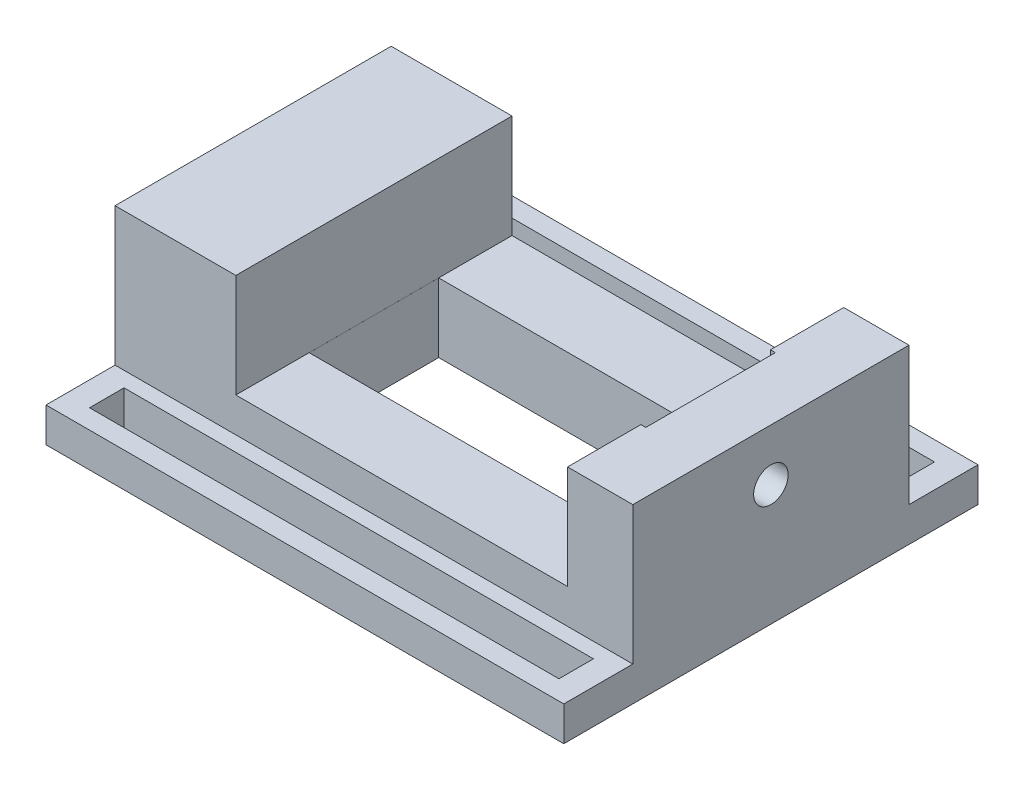
ISO-10303-21;
HEADER;
FILE_DESCRIPTION(('STEP AP214'),'2;1');
FILE_NAME('part.step','',(''),(''),'','','');
FILE_SCHEMA(('AUTOMOTIVE_DESIGN { 1 0 10303 214 1 1 1 1 }'));
ENDSEC;
DATA;
#1=APPLICATION_CONTEXT('core data for automotive mechanical design processes');
#2=APPLICATION_PROTOCOL_DEFINITION('international standard','automotive_design',2000,#1);
#3=PRODUCT_CONTEXT('',#1,'mechanical');
#4=PRODUCT('Part','Part','',(#3));
#5=PRODUCT_RELATED_PRODUCT_CATEGORY('part','',(#4));
#6=PRODUCT_DEFINITION_FORMATION('','',#4);
#7=PRODUCT_DEFINITION_CONTEXT('part definition',#1,'design');
#8=PRODUCT_DEFINITION('design','',#6,#7);
#9=PRODUCT_DEFINITION_SHAPE('','',#8);
#10=(LENGTH_UNIT() NAMED_UNIT(*) SI_UNIT(.MILLI.,.METRE.));
#11=(NAMED_UNIT(*) PLANE_ANGLE_UNIT() SI_UNIT($,.RADIAN.));
#12=(NAMED_UNIT(*) SI_UNIT($,.STERADIAN.) SOLID_ANGLE_UNIT());
#13=UNCERTAINTY_MEASURE_WITH_UNIT(LENGTH_MEASURE(1.E-05),#10,'distance_accuracy_value','');
#14=(GEOMETRIC_REPRESENTATION_CONTEXT(3) GLOBAL_UNCERTAINTY_ASSIGNED_CONTEXT((#13)) GLOBAL_UNIT_ASSIGNED_CONTEXT((#10,
#11,#12)) REPRESENTATION_CONTEXT('',''));
#15=CARTESIAN_POINT('',(0.,0.,0.));
#16=DIRECTION('',(0.,0.,1.));
#17=DIRECTION('',(1.,0.,0.));
#18=AXIS2_PLACEMENT_3D('',#15,#16,#17);
#19=CARTESIAN_POINT('',(56.092988376453,40.,-60.));
#20=DIRECTION('',(1.,0.,0.));
#21=DIRECTION('',(0.,1.,0.));
#22=AXIS2_PLACEMENT_3D('',#19,#20,#21);
#23=PLANE('',#22);
#24=DIRECTION('',(0.,0.,1.));
#25=VECTOR('',#24,1.);
#26=CARTESIAN_POINT('',(56.092988376453,10.,-60.));
#27=LINE('',#26,#25);
#28=CARTESIAN_POINT('',(56.092988376453,10.,-40.));
#29=VERTEX_POINT('',#28);
#30=CARTESIAN_POINT('',(56.092988376453,10.,-18.7674200357719));
#31=VERTEX_POINT('',#30);
#32=EDGE_CURVE('E282',#29,#31,#27,.T.);
#33=ORIENTED_EDGE('',*,*,#32,.T.);
#34=DIRECTION('',(0.,1.,0.));
#35=VECTOR('',#34,1.);
#36=CARTESIAN_POINT('',(56.092988376453,40.,-18.7674200357719));
#37=LINE('',#36,#35);
#38=CARTESIAN_POINT('',(56.092988376453,40.,-18.7674200357719));
#39=VERTEX_POINT('',#38);
#40=EDGE_CURVE('E49',#31,#39,#37,.T.);
#41=ORIENTED_EDGE('',*,*,#40,.T.);
#42=DIRECTION('',(0.,0.,-1.));
#43=VECTOR('',#42,1.);
#44=CARTESIAN_POINT('',(56.092988376453,40.,0.));
#45=LINE('',#44,#43);
#46=CARTESIAN_POINT('',(56.092988376453,40.,-40.));
#47=VERTEX_POINT('',#46);
#48=EDGE_CURVE('E473',#39,#47,#45,.T.);
#49=ORIENTED_EDGE('',*,*,#48,.T.);
#50=DIRECTION('',(0.,1.,0.));
#51=VECTOR('',#50,1.);
#52=CARTESIAN_POINT('',(56.092988376453,40.,-40.));
#53=LINE('',#52,#51);
#54=EDGE_CURVE('E286',#29,#47,#53,.T.);
#55=ORIENTED_EDGE('',*,*,#54,.F.);
#56=EDGE_LOOP('',(#33,#41,#49,#55));
#57=FACE_BOUND('',#56,.T.);
#58=ADVANCED_FACE('F39',(#57),#23,.F.);
#59=CARTESIAN_POINT('',(0.,40.,0.));
#60=DIRECTION('',(0.,1.,0.));
#61=DIRECTION('',(0.,0.,1.));
#62=AXIS2_PLACEMENT_3D('',#59,#60,#61);
#63=PLANE('',#62);
#64=DIRECTION('',(0.,0.,1.));
#65=VECTOR('',#64,1.);
#66=CARTESIAN_POINT('',(-40.,40.,0.));
#67=LINE('',#66,#65);
#68=CARTESIAN_POINT('',(-40.,40.,-40.));
#69=VERTEX_POINT('',#68);
#70=CARTESIAN_POINT('',(-40.,40.,40.));
#71=VERTEX_POINT('',#70);
#72=EDGE_CURVE('E477',#69,#71,#67,.T.);
#73=ORIENTED_EDGE('',*,*,#72,.F.);
#74=DIRECTION('',(-1.,0.,0.));
#75=VECTOR('',#74,1.);
#76=CARTESIAN_POINT('',(-75.,40.,-40.));
#77=LINE('',#76,#75);
#78=CARTESIAN_POINT('',(-75.,40.,-40.));
#79=VERTEX_POINT('',#78);
#80=EDGE_CURVE('E437',#69,#79,#77,.T.);
#81=ORIENTED_EDGE('',*,*,#80,.T.);
#82=DIRECTION('',(0.,0.,1.));
#83=VECTOR('',#82,1.);
#84=CARTESIAN_POINT('',(-75.,40.,-40.));
#85=LINE('',#84,#83);
#86=CARTESIAN_POINT('',(-75.,40.,40.));
#87=VERTEX_POINT('',#86);
#88=EDGE_CURVE('E443',#79,#87,#85,.T.);
#89=ORIENTED_EDGE('',*,*,#88,.T.);
#90=DIRECTION('',(1.,0.,0.));
#91=VECTOR('',#90,1.);
#92=CARTESIAN_POINT('',(-75.,40.,40.));
#93=LINE('',#92,#91);
#94=EDGE_CURVE('E447',#87,#71,#93,.T.);
#95=ORIENTED_EDGE('',*,*,#94,.T.);
#96=EDGE_LOOP('',(#73,#81,#89,#95));
#97=FACE_BOUND('',#96,.T.);
#98=ADVANCED_FACE('F563',(#97),#63,.T.);
#99=CARTESIAN_POINT('',(75.,40.,-40.));
#100=DIRECTION('',(-1.,0.,0.));
#101=DIRECTION('',(0.,0.,1.));
#102=AXIS2_PLACEMENT_3D('',#99,#100,#101);
#103=PLANE('',#102);
#104=CARTESIAN_POINT('',(75.,25.,0.));
#105=DIRECTION('',(1.,0.,0.));
#106=DIRECTION('',(0.,0.,-1.));
#107=AXIS2_PLACEMENT_3D('',#104,#105,#106);
#108=CIRCLE('',#107,5.);
#109=CARTESIAN_POINT('',(75.,25.,-4.99999999999999));
#110=VERTEX_POINT('',#109);
#111=EDGE_CURVE('E244',#110,#110,#108,.T.);
#112=ORIENTED_EDGE('',*,*,#111,.F.);
#113=EDGE_LOOP('',(#112));
#114=FACE_BOUND('',#113,.T.);
#115=DIRECTION('',(0.,-1.,0.));
#116=VECTOR('',#115,1.);
#117=CARTESIAN_POINT('',(75.,40.,40.));
#118=LINE('',#117,#116);
#119=CARTESIAN_POINT('',(75.,40.,40.));
#120=VERTEX_POINT('',#119);
#121=CARTESIAN_POINT('',(75.,0.,40.));
#122=VERTEX_POINT('',#121);
#123=EDGE_CURVE('E451',#120,#122,#118,.T.);
#124=ORIENTED_EDGE('',*,*,#123,.T.);
#125=DIRECTION('',(0.,0.,1.));
#126=VECTOR('',#125,1.);
#127=CARTESIAN_POINT('',(75.,0.,-60.));
#128=LINE('',#127,#126);
#129=CARTESIAN_POINT('',(75.,0.,60.));
#130=VERTEX_POINT('',#129);
#131=EDGE_CURVE('E410',#122,#130,#128,.T.);
#132=ORIENTED_EDGE('',*,*,#131,.T.);
#133=DIRECTION('',(0.,1.,0.));
#134=VECTOR('',#133,1.);
#135=CARTESIAN_POINT('',(75.,-10.,60.));
#136=LINE('',#135,#134);
#137=CARTESIAN_POINT('',(75.,-10.,60.));
#138=VERTEX_POINT('',#137);
#139=EDGE_CURVE('E420',#138,#130,#136,.T.);
#140=ORIENTED_EDGE('',*,*,#139,.F.);
#141=DIRECTION('',(0.,0.,1.));
#142=VECTOR('',#141,1.);
#143=CARTESIAN_POINT('',(75.,-10.,-60.));
#144=LINE('',#143,#142);
#145=CARTESIAN_POINT('',(75.,-10.,-60.));
#146=VERTEX_POINT('',#145);
#147=EDGE_CURVE('E396',#146,#138,#144,.T.);
#148=ORIENTED_EDGE('',*,*,#147,.F.);
#149=DIRECTION('',(0.,1.,0.));
#150=VECTOR('',#149,1.);
#151=CARTESIAN_POINT('',(75.,-10.,-60.));
#152=LINE('',#151,#150);
#153=CARTESIAN_POINT('',(75.,0.,-60.));
#154=VERTEX_POINT('',#153);
#155=EDGE_CURVE('E424',#146,#154,#152,.T.);
#156=ORIENTED_EDGE('',*,*,#155,.T.);
#157=CARTESIAN_POINT('',(75.,0.,-40.));
#158=VERTEX_POINT('',#157);
#159=EDGE_CURVE('E411',#154,#158,#128,.T.);
#160=ORIENTED_EDGE('',*,*,#159,.T.);
#161=DIRECTION('',(0.,-1.,0.));
#162=VECTOR('',#161,1.);
#163=CARTESIAN_POINT('',(75.,40.,-40.));
#164=LINE('',#163,#162);
#165=CARTESIAN_POINT('',(75.,40.,-40.));
#166=VERTEX_POINT('',#165);
#167=EDGE_CURVE('E469',#166,#158,#164,.T.);
#168=ORIENTED_EDGE('',*,*,#167,.F.);
#169=DIRECTION('',(0.,0.,-1.));
#170=VECTOR('',#169,1.);
#171=CARTESIAN_POINT('',(75.,40.,-40.));
#172=LINE('',#171,#170);
#173=EDGE_CURVE('E433',#120,#166,#172,.T.);
#174=ORIENTED_EDGE('',*,*,#173,.F.);
#175=EDGE_LOOP('',(#124,#132,#140,#148,#156,#160,#168,#174));
#176=FACE_BOUND('',#175,.T.);
#177=ADVANCED_FACE('F41',(#114,#176),#103,.F.);
#178=CARTESIAN_POINT('',(-75.,40.,-40.));
#179=DIRECTION('',(0.,0.,1.));
#180=DIRECTION('',(1.,0.,0.));
#181=AXIS2_PLACEMENT_3D('',#178,#179,#180);
#182=PLANE('',#181);
#183=ORIENTED_EDGE('',*,*,#80,.F.);
#184=DIRECTION('',(0.,-1.,0.));
#185=VECTOR('',#184,1.);
#186=CARTESIAN_POINT('',(-40.,40.,-40.));
#187=LINE('',#186,#185);
#188=CARTESIAN_POINT('',(-40.,10.,-40.));
#189=VERTEX_POINT('',#188);
#190=EDGE_CURVE('E293',#69,#189,#187,.T.);
#191=ORIENTED_EDGE('',*,*,#190,.T.);
#192=DIRECTION('',(1.,0.,0.));
#193=VECTOR('',#192,1.);
#194=CARTESIAN_POINT('',(-75.,10.,-40.));
#195=LINE('',#194,#193);
#196=EDGE_CURVE('E297',#189,#29,#195,.T.);
#197=ORIENTED_EDGE('',*,*,#196,.T.);
#198=ORIENTED_EDGE('',*,*,#54,.T.);
#199=EDGE_CURVE('E439',#166,#47,#77,.T.);
#200=ORIENTED_EDGE('',*,*,#199,.F.);
#201=ORIENTED_EDGE('',*,*,#167,.T.);
#202=DIRECTION('',(-1.,0.,0.));
#203=VECTOR('',#202,1.);
#204=CARTESIAN_POINT('',(-75.,0.,-40.));
#205=LINE('',#204,#203);
#206=CARTESIAN_POINT('',(-75.,0.,-40.));
#207=VERTEX_POINT('',#206);
#208=EDGE_CURVE('E432',#158,#207,#205,.T.);
#209=ORIENTED_EDGE('',*,*,#208,.T.);
#210=DIRECTION('',(0.,-1.,0.));
#211=VECTOR('',#210,1.);
#212=CARTESIAN_POINT('',(-75.,40.,-40.));
#213=LINE('',#212,#211);
#214=EDGE_CURVE('E465',#79,#207,#213,.T.);
#215=ORIENTED_EDGE('',*,*,#214,.F.);
#216=EDGE_LOOP('',(#183,#191,#197,#198,#200,#201,#209,#215));
#217=FACE_BOUND('',#216,.T.);
#218=ADVANCED_FACE('F512',(#217),#182,.F.);
#219=CARTESIAN_POINT('',(-75.,40.,-40.));
#220=DIRECTION('',(1.,0.,0.));
#221=DIRECTION('',(0.,0.,-1.));
#222=AXIS2_PLACEMENT_3D('',#219,#220,#221);
#223=PLANE('',#222);
#224=ORIENTED_EDGE('',*,*,#214,.T.);
#225=DIRECTION('',(0.,0.,-1.));
#226=VECTOR('',#225,1.);
#227=CARTESIAN_POINT('',(-75.,0.,-60.));
#228=LINE('',#227,#226);
#229=CARTESIAN_POINT('',(-75.,0.,-60.));
#230=VERTEX_POINT('',#229);
#231=EDGE_CURVE('E387',#207,#230,#228,.T.);
#232=ORIENTED_EDGE('',*,*,#231,.T.);
#233=DIRECTION('',(0.,1.,0.));
#234=VECTOR('',#233,1.);
#235=CARTESIAN_POINT('',(-75.,-10.,-60.));
#236=LINE('',#235,#234);
#237=CARTESIAN_POINT('',(-75.,-10.,-60.));
#238=VERTEX_POINT('',#237);
#239=EDGE_CURVE('E428',#238,#230,#236,.T.);
#240=ORIENTED_EDGE('',*,*,#239,.F.);
#241=DIRECTION('',(0.,0.,-1.));
#242=VECTOR('',#241,1.);
#243=CARTESIAN_POINT('',(-75.,-10.,-60.));
#244=LINE('',#243,#242);
#245=CARTESIAN_POINT('',(-75.,-10.,60.));
#246=VERTEX_POINT('',#245);
#247=EDGE_CURVE('E388',#246,#238,#244,.T.);
#248=ORIENTED_EDGE('',*,*,#247,.F.);
#249=DIRECTION('',(0.,1.,0.));
#250=VECTOR('',#249,1.);
#251=CARTESIAN_POINT('',(-75.,-10.,60.));
#252=LINE('',#251,#250);
#253=CARTESIAN_POINT('',(-75.,0.,60.));
#254=VERTEX_POINT('',#253);
#255=EDGE_CURVE('E402',#246,#254,#252,.T.);
#256=ORIENTED_EDGE('',*,*,#255,.T.);
#257=CARTESIAN_POINT('',(-75.,0.,40.));
#258=VERTEX_POINT('',#257);
#259=EDGE_CURVE('E403',#254,#258,#228,.T.);
#260=ORIENTED_EDGE('',*,*,#259,.T.);
#261=DIRECTION('',(0.,-1.,0.));
#262=VECTOR('',#261,1.);
#263=CARTESIAN_POINT('',(-75.,40.,40.));
#264=LINE('',#263,#262);
#265=EDGE_CURVE('E461',#87,#258,#264,.T.);
#266=ORIENTED_EDGE('',*,*,#265,.F.);
#267=ORIENTED_EDGE('',*,*,#88,.F.);
#268=EDGE_LOOP('',(#224,#232,#240,#248,#256,#260,#266,#267));
#269=FACE_BOUND('',#268,.T.);
#270=ADVANCED_FACE('F585',(#269),#223,.F.);
#271=CARTESIAN_POINT('',(-75.,40.,40.));
#272=DIRECTION('',(0.,0.,-1.));
#273=DIRECTION('',(-1.,0.,0.));
#274=AXIS2_PLACEMENT_3D('',#271,#272,#273);
#275=PLANE('',#274);
#276=DIRECTION('',(1.,0.,0.));
#277=VECTOR('',#276,1.);
#278=CARTESIAN_POINT('',(-40.,10.,40.));
#279=LINE('',#278,#277);
#280=CARTESIAN_POINT('',(-40.,10.,40.));
#281=VERTEX_POINT('',#280);
#282=CARTESIAN_POINT('',(56.092988376453,10.,40.));
#283=VERTEX_POINT('',#282);
#284=EDGE_CURVE('E274',#281,#283,#279,.T.);
#285=ORIENTED_EDGE('',*,*,#284,.F.);
#286=DIRECTION('',(0.,-1.,0.));
#287=VECTOR('',#286,1.);
#288=CARTESIAN_POINT('',(-40.,40.,40.));
#289=LINE('',#288,#287);
#290=EDGE_CURVE('E270',#71,#281,#289,.T.);
#291=ORIENTED_EDGE('',*,*,#290,.F.);
#292=ORIENTED_EDGE('',*,*,#94,.F.);
#293=ORIENTED_EDGE('',*,*,#265,.T.);
#294=DIRECTION('',(1.,0.,0.));
#295=VECTOR('',#294,1.);
#296=CARTESIAN_POINT('',(-75.,0.,40.));
#297=LINE('',#296,#295);
#298=EDGE_CURVE('E438',#258,#122,#297,.T.);
#299=ORIENTED_EDGE('',*,*,#298,.T.);
#300=ORIENTED_EDGE('',*,*,#123,.F.);
#301=CARTESIAN_POINT('',(56.092988376453,40.,40.));
#302=VERTEX_POINT('',#301);
#303=EDGE_CURVE('E446',#302,#120,#93,.T.);
#304=ORIENTED_EDGE('',*,*,#303,.F.);
#305=DIRECTION('',(0.,1.,0.));
#306=VECTOR('',#305,1.);
#307=CARTESIAN_POINT('',(56.092988376453,40.,40.));
#308=LINE('',#307,#306);
#309=EDGE_CURVE('E278',#283,#302,#308,.T.);
#310=ORIENTED_EDGE('',*,*,#309,.F.);
#311=EDGE_LOOP('',(#285,#291,#292,#293,#299,#300,#304,#310));
#312=FACE_BOUND('',#311,.T.);
#313=ADVANCED_FACE('F504',(#312),#275,.F.);
#314=DIRECTION('',(1.,0.,0.));
#315=VECTOR('',#314,1.);
#316=CARTESIAN_POINT('',(-39.9950006249219,40.,-18.7674200357719));
#317=LINE('',#316,#315);
#318=CARTESIAN_POINT('',(57.5152228321585,40.,-18.7674200357719));
#319=VERTEX_POINT('',#318);
#320=EDGE_CURVE('E223',#39,#319,#317,.T.);
#321=ORIENTED_EDGE('',*,*,#320,.T.);
#322=DIRECTION('',(0.,0.,1.));
#323=VECTOR('',#322,1.);
#324=CARTESIAN_POINT('',(57.5152228321585,40.,18.7674200357719));
#325=LINE('',#324,#323);
#326=CARTESIAN_POINT('',(57.5152228321585,40.,18.7674200357719));
#327=VERTEX_POINT('',#326);
#328=EDGE_CURVE('E217',#319,#327,#325,.T.);
#329=ORIENTED_EDGE('',*,*,#328,.T.);
#330=DIRECTION('',(-1.,0.,0.));
#331=VECTOR('',#330,1.);
#332=CARTESIAN_POINT('',(-39.9950006249219,40.,18.7674200357719));
#333=LINE('',#332,#331);
#334=CARTESIAN_POINT('',(56.092988376453,40.,18.7674200357719));
#335=VERTEX_POINT('',#334);
#336=EDGE_CURVE('E226',#327,#335,#333,.T.);
#337=ORIENTED_EDGE('',*,*,#336,.T.);
#338=EDGE_CURVE('E474',#302,#335,#45,.T.);
#339=ORIENTED_EDGE('',*,*,#338,.F.);
#340=ORIENTED_EDGE('',*,*,#303,.T.);
#341=ORIENTED_EDGE('',*,*,#173,.T.);
#342=ORIENTED_EDGE('',*,*,#199,.T.);
#343=ORIENTED_EDGE('',*,*,#48,.F.);
#344=EDGE_LOOP('',(#321,#329,#337,#339,#340,#341,#342,#343));
#345=FACE_BOUND('',#344,.T.);
#346=ADVANCED_FACE('F234',(#345),#63,.T.);
#347=CARTESIAN_POINT('',(0.,0.,0.));
#348=DIRECTION('',(0.,-1.,0.));
#349=DIRECTION('',(0.,0.,-1.));
#350=AXIS2_PLACEMENT_3D('',#347,#348,#349);
#351=PLANE('',#350);
#352=ORIENTED_EDGE('',*,*,#298,.F.);
#353=ORIENTED_EDGE('',*,*,#259,.F.);
#354=DIRECTION('',(-1.,0.,0.));
#355=VECTOR('',#354,1.);
#356=CARTESIAN_POINT('',(75.,0.,60.));
#357=LINE('',#356,#355);
#358=EDGE_CURVE('E393',#130,#254,#357,.T.);
#359=ORIENTED_EDGE('',*,*,#358,.F.);
#360=ORIENTED_EDGE('',*,*,#131,.F.);
#361=EDGE_LOOP('',(#352,#353,#359,#360));
#362=FACE_BOUND('',#361,.T.);
#363=DIRECTION('',(0.,0.,-1.));
#364=VECTOR('',#363,1.);
#365=CARTESIAN_POINT('',(-67.9915010623671,0.,44.3932008498937));
#366=LINE('',#365,#364);
#367=CARTESIAN_POINT('',(-67.9915010623671,0.,54.3932008498937));
#368=VERTEX_POINT('',#367);
#369=CARTESIAN_POINT('',(-67.9915010623671,0.,44.3932008498937));
#370=VERTEX_POINT('',#369);
#371=EDGE_CURVE('E344',#368,#370,#366,.T.);
#372=ORIENTED_EDGE('',*,*,#371,.T.);
#373=DIRECTION('',(1.,0.,0.));
#374=VECTOR('',#373,1.);
#375=CARTESIAN_POINT('',(-67.9915010623671,0.,44.3932008498937));
#376=LINE('',#375,#374);
#377=CARTESIAN_POINT('',(67.9915010623671,0.,44.3932008498937));
#378=VERTEX_POINT('',#377);
#379=EDGE_CURVE('E363',#370,#378,#376,.T.);
#380=ORIENTED_EDGE('',*,*,#379,.T.);
#381=DIRECTION('',(0.,0.,1.));
#382=VECTOR('',#381,1.);
#383=CARTESIAN_POINT('',(67.9915010623671,0.,44.3932008498937));
#384=LINE('',#383,#382);
#385=CARTESIAN_POINT('',(67.9915010623671,0.,54.3932008498937));
#386=VERTEX_POINT('',#385);
#387=EDGE_CURVE('E367',#378,#386,#384,.T.);
#388=ORIENTED_EDGE('',*,*,#387,.T.);
#389=DIRECTION('',(-1.,0.,0.));
#390=VECTOR('',#389,1.);
#391=CARTESIAN_POINT('',(-67.9915010623671,0.,54.3932008498937));
#392=LINE('',#391,#390);
#393=EDGE_CURVE('E349',#386,#368,#392,.T.);
#394=ORIENTED_EDGE('',*,*,#393,.T.);
#395=EDGE_LOOP('',(#372,#380,#388,#394));
#396=FACE_BOUND('',#395,.T.);
#397=ADVANCED_FACE('F525',(#362,#396),#351,.F.);
#398=CARTESIAN_POINT('',(0.,-10.,0.));
#399=DIRECTION('',(0.,-1.,0.));
#400=DIRECTION('',(0.,0.,-1.));
#401=AXIS2_PLACEMENT_3D('',#398,#399,#400);
#402=PLANE('',#401);
#403=DIRECTION('',(0.,0.,1.));
#404=VECTOR('',#403,1.);
#405=CARTESIAN_POINT('',(57.5152228321585,-10.,18.7674200357719));
#406=LINE('',#405,#404);
#407=CARTESIAN_POINT('',(57.5152228321585,-10.,-18.7674200357719));
#408=VERTEX_POINT('',#407);
#409=CARTESIAN_POINT('',(57.5152228321585,-10.,18.7674200357719));
#410=VERTEX_POINT('',#409);
#411=EDGE_CURVE('E56',#408,#410,#406,.T.);
#412=ORIENTED_EDGE('',*,*,#411,.F.);
#413=DIRECTION('',(1.,0.,0.));
#414=VECTOR('',#413,1.);
#415=CARTESIAN_POINT('',(-39.9950006249219,-10.,-18.7674200357719));
#416=LINE('',#415,#414);
#417=CARTESIAN_POINT('',(-39.9950006249219,-10.,-18.7674200357719));
#418=VERTEX_POINT('',#417);
#419=EDGE_CURVE('E237',#418,#408,#416,.T.);
#420=ORIENTED_EDGE('',*,*,#419,.F.);
#421=DIRECTION('',(0.,0.,-1.));
#422=VECTOR('',#421,1.);
#423=CARTESIAN_POINT('',(-39.9950006249219,-10.,18.7674200357719));
#424=LINE('',#423,#422);
#425=CARTESIAN_POINT('',(-39.9950006249219,-10.,18.7674200357719));
#426=VERTEX_POINT('',#425);
#427=EDGE_CURVE('E241',#426,#418,#424,.T.);
#428=ORIENTED_EDGE('',*,*,#427,.F.);
#429=DIRECTION('',(-1.,0.,0.));
#430=VECTOR('',#429,1.);
#431=CARTESIAN_POINT('',(-39.9950006249219,-10.,18.7674200357719));
#432=LINE('',#431,#430);
#433=EDGE_CURVE('E250',#410,#426,#432,.T.);
#434=ORIENTED_EDGE('',*,*,#433,.F.);
#435=EDGE_LOOP('',(#412,#420,#428,#434));
#436=FACE_BOUND('',#435,.T.);
#437=ORIENTED_EDGE('',*,*,#247,.T.);
#438=DIRECTION('',(1.,0.,0.));
#439=VECTOR('',#438,1.);
#440=CARTESIAN_POINT('',(75.,-10.,-60.));
#441=LINE('',#440,#439);
#442=EDGE_CURVE('E392',#238,#146,#441,.T.);
#443=ORIENTED_EDGE('',*,*,#442,.T.);
#444=ORIENTED_EDGE('',*,*,#147,.T.);
#445=DIRECTION('',(-1.,0.,0.));
#446=VECTOR('',#445,1.);
#447=CARTESIAN_POINT('',(75.,-10.,60.));
#448=LINE('',#447,#446);
#449=EDGE_CURVE('E399',#138,#246,#448,.T.);
#450=ORIENTED_EDGE('',*,*,#449,.T.);
#451=EDGE_LOOP('',(#437,#443,#444,#450));
#452=FACE_BOUND('',#451,.T.);
#453=DIRECTION('',(1.,0.,0.));
#454=VECTOR('',#453,1.);
#455=CARTESIAN_POINT('',(-67.9915010623671,-10.,44.3932008498937));
#456=LINE('',#455,#454);
#457=CARTESIAN_POINT('',(-67.9915010623671,-10.,44.3932008498937));
#458=VERTEX_POINT('',#457);
#459=CARTESIAN_POINT('',(67.9915010623671,-10.,44.3932008498937));
#460=VERTEX_POINT('',#459);
#461=EDGE_CURVE('E348',#458,#460,#456,.T.);
#462=ORIENTED_EDGE('',*,*,#461,.F.);
#463=DIRECTION('',(0.,0.,-1.));
#464=VECTOR('',#463,1.);
#465=CARTESIAN_POINT('',(-67.9915010623671,-10.,44.3932008498937));
#466=LINE('',#465,#464);
#467=CARTESIAN_POINT('',(-67.9915010623671,-10.,54.3932008498937));
#468=VERTEX_POINT('',#467);
#469=EDGE_CURVE('E345',#468,#458,#466,.T.);
#470=ORIENTED_EDGE('',*,*,#469,.F.);
#471=DIRECTION('',(-1.,0.,0.));
#472=VECTOR('',#471,1.);
#473=CARTESIAN_POINT('',(-67.9915010623671,-10.,54.3932008498937));
#474=LINE('',#473,#472);
#475=CARTESIAN_POINT('',(67.9915010623671,-10.,54.3932008498937));
#476=VERTEX_POINT('',#475);
#477=EDGE_CURVE('E356',#476,#468,#474,.T.);
#478=ORIENTED_EDGE('',*,*,#477,.F.);
#479=DIRECTION('',(0.,0.,1.));
#480=VECTOR('',#479,1.);
#481=CARTESIAN_POINT('',(67.9915010623671,-10.,44.3932008498937));
#482=LINE('',#481,#480);
#483=EDGE_CURVE('E352',#460,#476,#482,.T.);
#484=ORIENTED_EDGE('',*,*,#483,.F.);
#485=EDGE_LOOP('',(#462,#470,#478,#484));
#486=FACE_BOUND('',#485,.T.);
#487=DIRECTION('',(0.,0.,-1.));
#488=VECTOR('',#487,1.);
#489=CARTESIAN_POINT('',(-67.9915010623671,-10.,-44.3932008498937));
#490=LINE('',#489,#488);
#491=CARTESIAN_POINT('',(-67.9915010623671,-10.,-44.3932008498937));
#492=VERTEX_POINT('',#491);
#493=CARTESIAN_POINT('',(-67.9915010623671,-10.,-54.3932008498937));
#494=VERTEX_POINT('',#493);
#495=EDGE_CURVE('E305',#492,#494,#490,.T.);
#496=ORIENTED_EDGE('',*,*,#495,.F.);
#497=DIRECTION('',(-1.,0.,0.));
#498=VECTOR('',#497,1.);
#499=CARTESIAN_POINT('',(-67.9915010623671,-10.,-44.3932008498937));
#500=LINE('',#499,#498);
#501=CARTESIAN_POINT('',(67.9915010623671,-10.,-44.3932008498937));
#502=VERTEX_POINT('',#501);
#503=EDGE_CURVE('E302',#502,#492,#500,.T.);
#504=ORIENTED_EDGE('',*,*,#503,.F.);
#505=DIRECTION('',(0.,0.,1.));
#506=VECTOR('',#505,1.);
#507=CARTESIAN_POINT('',(67.9915010623671,-10.,-44.3932008498937));
#508=LINE('',#507,#506);
#509=CARTESIAN_POINT('',(67.9915010623671,-10.,-54.3932008498937));
#510=VERTEX_POINT('',#509);
#511=EDGE_CURVE('E313',#510,#502,#508,.T.);
#512=ORIENTED_EDGE('',*,*,#511,.F.);
#513=DIRECTION('',(1.,0.,0.));
#514=VECTOR('',#513,1.);
#515=CARTESIAN_POINT('',(-67.9915010623671,-10.,-54.3932008498937));
#516=LINE('',#515,#514);
#517=EDGE_CURVE('E309',#494,#510,#516,.T.);
#518=ORIENTED_EDGE('',*,*,#517,.F.);
#519=EDGE_LOOP('',(#496,#504,#512,#518));
#520=FACE_BOUND('',#519,.T.);
#521=ADVANCED_FACE('F521',(#436,#452,#486,#520),#402,.T.);
#522=ORIENTED_EDGE('',*,*,#208,.F.);
#523=ORIENTED_EDGE('',*,*,#159,.F.);
#524=DIRECTION('',(1.,0.,0.));
#525=VECTOR('',#524,1.);
#526=CARTESIAN_POINT('',(75.,0.,-60.));
#527=LINE('',#526,#525);
#528=EDGE_CURVE('E407',#230,#154,#527,.T.);
#529=ORIENTED_EDGE('',*,*,#528,.F.);
#530=ORIENTED_EDGE('',*,*,#231,.F.);
#531=EDGE_LOOP('',(#522,#523,#529,#530));
#532=FACE_BOUND('',#531,.T.);
#533=DIRECTION('',(-1.,0.,0.));
#534=VECTOR('',#533,1.);
#535=CARTESIAN_POINT('',(-67.9915010623671,0.,-44.3932008498937));
#536=LINE('',#535,#534);
#537=CARTESIAN_POINT('',(67.9915010623671,0.,-44.3932008498937));
#538=VERTEX_POINT('',#537);
#539=CARTESIAN_POINT('',(-67.9915010623671,0.,-44.3932008498937));
#540=VERTEX_POINT('',#539);
#541=EDGE_CURVE('E301',#538,#540,#536,.T.);
#542=ORIENTED_EDGE('',*,*,#541,.T.);
#543=DIRECTION('',(0.,0.,-1.));
#544=VECTOR('',#543,1.);
#545=CARTESIAN_POINT('',(-67.9915010623671,0.,-44.3932008498937));
#546=LINE('',#545,#544);
#547=CARTESIAN_POINT('',(-67.9915010623671,0.,-54.3932008498937));
#548=VERTEX_POINT('',#547);
#549=EDGE_CURVE('E320',#540,#548,#546,.T.);
#550=ORIENTED_EDGE('',*,*,#549,.T.);
#551=DIRECTION('',(1.,0.,0.));
#552=VECTOR('',#551,1.);
#553=CARTESIAN_POINT('',(-67.9915010623671,0.,-54.3932008498937));
#554=LINE('',#553,#552);
#555=CARTESIAN_POINT('',(67.9915010623671,0.,-54.3932008498937));
#556=VERTEX_POINT('',#555);
#557=EDGE_CURVE('E324',#548,#556,#554,.T.);
#558=ORIENTED_EDGE('',*,*,#557,.T.);
#559=DIRECTION('',(0.,0.,1.));
#560=VECTOR('',#559,1.);
#561=CARTESIAN_POINT('',(67.9915010623671,0.,-44.3932008498937));
#562=LINE('',#561,#560);
#563=EDGE_CURVE('E306',#556,#538,#562,.T.);
#564=ORIENTED_EDGE('',*,*,#563,.T.);
#565=EDGE_LOOP('',(#542,#550,#558,#564));
#566=FACE_BOUND('',#565,.T.);
#567=ADVANCED_FACE('F524',(#532,#566),#351,.F.);
#568=CARTESIAN_POINT('',(75.,-10.,-60.));
#569=DIRECTION('',(0.,0.,1.));
#570=DIRECTION('',(1.,0.,0.));
#571=AXIS2_PLACEMENT_3D('',#568,#569,#570);
#572=PLANE('',#571);
#573=ORIENTED_EDGE('',*,*,#528,.T.);
#574=ORIENTED_EDGE('',*,*,#155,.F.);
#575=ORIENTED_EDGE('',*,*,#442,.F.);
#576=ORIENTED_EDGE('',*,*,#239,.T.);
#577=EDGE_LOOP('',(#573,#574,#575,#576));
#578=FACE_BOUND('',#577,.T.);
#579=ADVANCED_FACE('F625',(#578),#572,.F.);
#580=CARTESIAN_POINT('',(75.,-10.,60.));
#581=DIRECTION('',(0.,0.,-1.));
#582=DIRECTION('',(-1.,0.,0.));
#583=AXIS2_PLACEMENT_3D('',#580,#581,#582);
#584=PLANE('',#583);
#585=ORIENTED_EDGE('',*,*,#358,.T.);
#586=ORIENTED_EDGE('',*,*,#255,.F.);
#587=ORIENTED_EDGE('',*,*,#449,.F.);
#588=ORIENTED_EDGE('',*,*,#139,.T.);
#589=EDGE_LOOP('',(#585,#586,#587,#588));
#590=FACE_BOUND('',#589,.T.);
#591=ADVANCED_FACE('F593',(#590),#584,.F.);
#592=CARTESIAN_POINT('',(-67.9915010623671,-10.,44.3932008498937));
#593=DIRECTION('',(1.,0.,0.));
#594=DIRECTION('',(0.,0.,-1.));
#595=AXIS2_PLACEMENT_3D('',#592,#593,#594);
#596=PLANE('',#595);
#597=ORIENTED_EDGE('',*,*,#371,.F.);
#598=DIRECTION('',(0.,1.,0.));
#599=VECTOR('',#598,1.);
#600=CARTESIAN_POINT('',(-67.9915010623671,-10.,54.3932008498937));
#601=LINE('',#600,#599);
#602=EDGE_CURVE('E359',#468,#368,#601,.T.);
#603=ORIENTED_EDGE('',*,*,#602,.F.);
#604=ORIENTED_EDGE('',*,*,#469,.T.);
#605=DIRECTION('',(0.,1.,0.));
#606=VECTOR('',#605,1.);
#607=CARTESIAN_POINT('',(-67.9915010623671,-10.,44.3932008498937));
#608=LINE('',#607,#606);
#609=EDGE_CURVE('E383',#458,#370,#608,.T.);
#610=ORIENTED_EDGE('',*,*,#609,.T.);
#611=EDGE_LOOP('',(#597,#603,#604,#610));
#612=FACE_BOUND('',#611,.T.);
#613=ADVANCED_FACE('F601',(#612),#596,.T.);
#614=CARTESIAN_POINT('',(-67.9915010623671,-10.,44.3932008498937));
#615=DIRECTION('',(0.,0.,1.));
#616=DIRECTION('',(1.,0.,0.));
#617=AXIS2_PLACEMENT_3D('',#614,#615,#616);
#618=PLANE('',#617);
#619=ORIENTED_EDGE('',*,*,#379,.F.);
#620=ORIENTED_EDGE('',*,*,#609,.F.);
#621=ORIENTED_EDGE('',*,*,#461,.T.);
#622=DIRECTION('',(0.,1.,0.));
#623=VECTOR('',#622,1.);
#624=CARTESIAN_POINT('',(67.9915010623671,-10.,44.3932008498937));
#625=LINE('',#624,#623);
#626=EDGE_CURVE('E380',#460,#378,#625,.T.);
#627=ORIENTED_EDGE('',*,*,#626,.T.);
#628=EDGE_LOOP('',(#619,#620,#621,#627));
#629=FACE_BOUND('',#628,.T.);
#630=ADVANCED_FACE('F607',(#629),#618,.T.);
#631=CARTESIAN_POINT('',(67.9915010623671,-10.,44.3932008498937));
#632=DIRECTION('',(-1.,0.,0.));
#633=DIRECTION('',(0.,0.,1.));
#634=AXIS2_PLACEMENT_3D('',#631,#632,#633);
#635=PLANE('',#634);
#636=ORIENTED_EDGE('',*,*,#387,.F.);
#637=ORIENTED_EDGE('',*,*,#626,.F.);
#638=ORIENTED_EDGE('',*,*,#483,.T.);
#639=DIRECTION('',(0.,1.,0.));
#640=VECTOR('',#639,1.);
#641=CARTESIAN_POINT('',(67.9915010623671,-10.,54.3932008498937));
#642=LINE('',#641,#640);
#643=EDGE_CURVE('E377',#476,#386,#642,.T.);
#644=ORIENTED_EDGE('',*,*,#643,.T.);
#645=EDGE_LOOP('',(#636,#637,#638,#644));
#646=FACE_BOUND('',#645,.T.);
#647=ADVANCED_FACE('F611',(#646),#635,.T.);
#648=CARTESIAN_POINT('',(-67.9915010623671,-10.,54.3932008498937));
#649=DIRECTION('',(0.,0.,-1.));
#650=DIRECTION('',(-1.,0.,0.));
#651=AXIS2_PLACEMENT_3D('',#648,#649,#650);
#652=PLANE('',#651);
#653=ORIENTED_EDGE('',*,*,#393,.F.);
#654=ORIENTED_EDGE('',*,*,#643,.F.);
#655=ORIENTED_EDGE('',*,*,#477,.T.);
#656=ORIENTED_EDGE('',*,*,#602,.T.);
#657=EDGE_LOOP('',(#653,#654,#655,#656));
#658=FACE_BOUND('',#657,.T.);
#659=ADVANCED_FACE('F604',(#658),#652,.T.);
#660=CARTESIAN_POINT('',(-67.9915010623671,-10.,-44.3932008498937));
#661=DIRECTION('',(0.,0.,-1.));
#662=DIRECTION('',(-1.,0.,0.));
#663=AXIS2_PLACEMENT_3D('',#660,#661,#662);
#664=PLANE('',#663);
#665=ORIENTED_EDGE('',*,*,#541,.F.);
#666=DIRECTION('',(0.,1.,0.));
#667=VECTOR('',#666,1.);
#668=CARTESIAN_POINT('',(67.9915010623671,-10.,-44.3932008498937));
#669=LINE('',#668,#667);
#670=EDGE_CURVE('E316',#502,#538,#669,.T.);
#671=ORIENTED_EDGE('',*,*,#670,.F.);
#672=ORIENTED_EDGE('',*,*,#503,.T.);
#673=DIRECTION('',(0.,1.,0.));
#674=VECTOR('',#673,1.);
#675=CARTESIAN_POINT('',(-67.9915010623671,-10.,-44.3932008498937));
#676=LINE('',#675,#674);
#677=EDGE_CURVE('E340',#492,#540,#676,.T.);
#678=ORIENTED_EDGE('',*,*,#677,.T.);
#679=EDGE_LOOP('',(#665,#671,#672,#678));
#680=FACE_BOUND('',#679,.T.);
#681=ADVANCED_FACE('F548',(#680),#664,.T.);
#682=CARTESIAN_POINT('',(-67.9915010623671,-10.,-44.3932008498937));
#683=DIRECTION('',(1.,0.,0.));
#684=DIRECTION('',(0.,0.,-1.));
#685=AXIS2_PLACEMENT_3D('',#682,#683,#684);
#686=PLANE('',#685);
#687=ORIENTED_EDGE('',*,*,#549,.F.);
#688=ORIENTED_EDGE('',*,*,#677,.F.);
#689=ORIENTED_EDGE('',*,*,#495,.T.);
#690=DIRECTION('',(0.,1.,0.));
#691=VECTOR('',#690,1.);
#692=CARTESIAN_POINT('',(-67.9915010623671,-10.,-54.3932008498937));
#693=LINE('',#692,#691);
#694=EDGE_CURVE('E337',#494,#548,#693,.T.);
#695=ORIENTED_EDGE('',*,*,#694,.T.);
#696=EDGE_LOOP('',(#687,#688,#689,#695));
#697=FACE_BOUND('',#696,.T.);
#698=ADVANCED_FACE('F541',(#697),#686,.T.);
#699=CARTESIAN_POINT('',(-67.9915010623671,-10.,-54.3932008498937));
#700=DIRECTION('',(0.,0.,1.));
#701=DIRECTION('',(1.,0.,0.));
#702=AXIS2_PLACEMENT_3D('',#699,#700,#701);
#703=PLANE('',#702);
#704=ORIENTED_EDGE('',*,*,#557,.F.);
#705=ORIENTED_EDGE('',*,*,#694,.F.);
#706=ORIENTED_EDGE('',*,*,#517,.T.);
#707=DIRECTION('',(0.,1.,0.));
#708=VECTOR('',#707,1.);
#709=CARTESIAN_POINT('',(67.9915010623671,-10.,-54.3932008498937));
#710=LINE('',#709,#708);
#711=EDGE_CURVE('E334',#510,#556,#710,.T.);
#712=ORIENTED_EDGE('',*,*,#711,.T.);
#713=EDGE_LOOP('',(#704,#705,#706,#712));
#714=FACE_BOUND('',#713,.T.);
#715=ADVANCED_FACE('F544',(#714),#703,.T.);
#716=CARTESIAN_POINT('',(67.9915010623671,-10.,-44.3932008498937));
#717=DIRECTION('',(-1.,0.,0.));
#718=DIRECTION('',(0.,0.,1.));
#719=AXIS2_PLACEMENT_3D('',#716,#717,#718);
#720=PLANE('',#719);
#721=ORIENTED_EDGE('',*,*,#563,.F.);
#722=ORIENTED_EDGE('',*,*,#711,.F.);
#723=ORIENTED_EDGE('',*,*,#511,.T.);
#724=ORIENTED_EDGE('',*,*,#670,.T.);
#725=EDGE_LOOP('',(#721,#722,#723,#724));
#726=FACE_BOUND('',#725,.T.);
#727=ADVANCED_FACE('F551',(#726),#720,.T.);
#728=CARTESIAN_POINT('',(-40.,10.,-60.));
#729=DIRECTION('',(0.,-1.,0.));
#730=DIRECTION('',(0.,0.,-1.));
#731=AXIS2_PLACEMENT_3D('',#728,#729,#730);
#732=PLANE('',#731);
#733=DIRECTION('',(0.,0.,-1.));
#734=VECTOR('',#733,1.);
#735=CARTESIAN_POINT('',(-39.9950006249219,10.,-60.));
#736=LINE('',#735,#734);
#737=CARTESIAN_POINT('',(-39.9950006249219,10.,18.7674200357719));
#738=VERTEX_POINT('',#737);
#739=CARTESIAN_POINT('',(-39.9950006249219,10.,-18.7674200357719));
#740=VERTEX_POINT('',#739);
#741=EDGE_CURVE('E11',#738,#740,#736,.T.);
#742=ORIENTED_EDGE('',*,*,#741,.T.);
#743=DIRECTION('',(1.,0.,0.));
#744=VECTOR('',#743,1.);
#745=CARTESIAN_POINT('',(-40.,10.,-18.7674200357719));
#746=LINE('',#745,#744);
#747=EDGE_CURVE('E266',#740,#31,#746,.T.);
#748=ORIENTED_EDGE('',*,*,#747,.T.);
#749=ORIENTED_EDGE('',*,*,#32,.F.);
#750=ORIENTED_EDGE('',*,*,#196,.F.);
#751=DIRECTION('',(0.,0.,1.));
#752=VECTOR('',#751,1.);
#753=CARTESIAN_POINT('',(-40.,10.,-60.));
#754=LINE('',#753,#752);
#755=EDGE_CURVE('E281',#189,#281,#754,.T.);
#756=ORIENTED_EDGE('',*,*,#755,.T.);
#757=ORIENTED_EDGE('',*,*,#284,.T.);
#758=CARTESIAN_POINT('',(56.092988376453,10.,18.7674200357719));
#759=VERTEX_POINT('',#758);
#760=EDGE_CURVE('E287',#759,#283,#27,.T.);
#761=ORIENTED_EDGE('',*,*,#760,.F.);
#762=DIRECTION('',(-1.,0.,0.));
#763=VECTOR('',#762,1.);
#764=CARTESIAN_POINT('',(-40.,10.,18.7674200357719));
#765=LINE('',#764,#763);
#766=EDGE_CURVE('E64',#759,#738,#765,.T.);
#767=ORIENTED_EDGE('',*,*,#766,.T.);
#768=EDGE_LOOP('',(#742,#748,#749,#750,#756,#757,#761,#767));
#769=FACE_BOUND('',#768,.T.);
#770=ADVANCED_FACE('F499',(#769),#732,.F.);
#771=CARTESIAN_POINT('',(-40.,40.,-60.));
#772=DIRECTION('',(-1.,0.,0.));
#773=DIRECTION('',(0.,-1.,0.));
#774=AXIS2_PLACEMENT_3D('',#771,#772,#773);
#775=PLANE('',#774);
#776=ORIENTED_EDGE('',*,*,#72,.T.);
#777=ORIENTED_EDGE('',*,*,#290,.T.);
#778=ORIENTED_EDGE('',*,*,#755,.F.);
#779=ORIENTED_EDGE('',*,*,#190,.F.);
#780=EDGE_LOOP('',(#776,#777,#778,#779));
#781=FACE_BOUND('',#780,.T.);
#782=ADVANCED_FACE('F558',(#781),#775,.F.);
#783=ORIENTED_EDGE('',*,*,#338,.T.);
#784=DIRECTION('',(0.,-1.,0.));
#785=VECTOR('',#784,1.);
#786=CARTESIAN_POINT('',(56.092988376453,40.,18.7674200357719));
#787=LINE('',#786,#785);
#788=EDGE_CURVE('E228',#335,#759,#787,.T.);
#789=ORIENTED_EDGE('',*,*,#788,.T.);
#790=ORIENTED_EDGE('',*,*,#760,.T.);
#791=ORIENTED_EDGE('',*,*,#309,.T.);
#792=EDGE_LOOP('',(#783,#789,#790,#791));
#793=FACE_BOUND('',#792,.T.);
#794=ADVANCED_FACE('F495',(#793),#23,.F.);
#795=CARTESIAN_POINT('',(-39.9950006249219,40.,18.7674200357719));
#796=DIRECTION('',(-1.,0.,0.));
#797=DIRECTION('',(0.,0.,1.));
#798=AXIS2_PLACEMENT_3D('',#795,#796,#797);
#799=PLANE('',#798);
#800=DIRECTION('',(0.,-1.,0.));
#801=VECTOR('',#800,1.);
#802=CARTESIAN_POINT('',(-39.9950006249219,40.,18.7674200357719));
#803=LINE('',#802,#801);
#804=EDGE_CURVE('E222',#738,#426,#803,.T.);
#805=ORIENTED_EDGE('',*,*,#804,.T.);
#806=ORIENTED_EDGE('',*,*,#427,.T.);
#807=DIRECTION('',(0.,-1.,0.));
#808=VECTOR('',#807,1.);
#809=CARTESIAN_POINT('',(-39.9950006249219,40.,-18.7674200357719));
#810=LINE('',#809,#808);
#811=EDGE_CURVE('E259',#740,#418,#810,.T.);
#812=ORIENTED_EDGE('',*,*,#811,.F.);
#813=ORIENTED_EDGE('',*,*,#741,.F.);
#814=EDGE_LOOP('',(#805,#806,#812,#813));
#815=FACE_BOUND('',#814,.T.);
#816=ADVANCED_FACE('F517',(#815),#799,.F.);
#817=CARTESIAN_POINT('',(-39.9950006249219,40.,-18.7674200357719));
#818=DIRECTION('',(0.,0.,-1.));
#819=DIRECTION('',(-1.,0.,0.));
#820=AXIS2_PLACEMENT_3D('',#817,#818,#819);
#821=PLANE('',#820);
#822=ORIENTED_EDGE('',*,*,#811,.T.);
#823=ORIENTED_EDGE('',*,*,#419,.T.);
#824=DIRECTION('',(0.,-1.,0.));
#825=VECTOR('',#824,1.);
#826=CARTESIAN_POINT('',(57.5152228321585,40.,-18.7674200357719));
#827=LINE('',#826,#825);
#828=EDGE_CURVE('E256',#319,#408,#827,.T.);
#829=ORIENTED_EDGE('',*,*,#828,.F.);
#830=ORIENTED_EDGE('',*,*,#320,.F.);
#831=ORIENTED_EDGE('',*,*,#40,.F.);
#832=ORIENTED_EDGE('',*,*,#747,.F.);
#833=EDGE_LOOP('',(#822,#823,#829,#830,#831,#832));
#834=FACE_BOUND('',#833,.T.);
#835=ADVANCED_FACE('F515',(#834),#821,.F.);
#836=CARTESIAN_POINT('',(-39.9950006249219,40.,18.7674200357719));
#837=DIRECTION('',(0.,0.,1.));
#838=DIRECTION('',(1.,0.,0.));
#839=AXIS2_PLACEMENT_3D('',#836,#837,#838);
#840=PLANE('',#839);
#841=ORIENTED_EDGE('',*,*,#788,.F.);
#842=ORIENTED_EDGE('',*,*,#336,.F.);
#843=DIRECTION('',(0.,-1.,0.));
#844=VECTOR('',#843,1.);
#845=CARTESIAN_POINT('',(57.5152228321585,40.,18.7674200357719));
#846=LINE('',#845,#844);
#847=EDGE_CURVE('E213',#327,#410,#846,.T.);
#848=ORIENTED_EDGE('',*,*,#847,.T.);
#849=ORIENTED_EDGE('',*,*,#433,.T.);
#850=ORIENTED_EDGE('',*,*,#804,.F.);
#851=ORIENTED_EDGE('',*,*,#766,.F.);
#852=EDGE_LOOP('',(#841,#842,#848,#849,#850,#851));
#853=FACE_BOUND('',#852,.T.);
#854=ADVANCED_FACE('F227',(#853),#840,.F.);
#855=CARTESIAN_POINT('',(57.5152228321585,40.,18.7674200357719));
#856=DIRECTION('',(1.,0.,0.));
#857=DIRECTION('',(0.,0.,-1.));
#858=AXIS2_PLACEMENT_3D('',#855,#856,#857);
#859=PLANE('',#858);
#860=CARTESIAN_POINT('',(57.5152228321585,25.,0.));
#861=DIRECTION('',(1.,0.,0.));
#862=DIRECTION('',(0.,0.,-1.));
#863=AXIS2_PLACEMENT_3D('',#860,#861,#862);
#864=CIRCLE('',#863,5.);
#865=CARTESIAN_POINT('',(57.5152228321585,25.,-4.99999999999999));
#866=VERTEX_POINT('',#865);
#867=EDGE_CURVE('E43',#866,#866,#864,.T.);
#868=ORIENTED_EDGE('',*,*,#867,.T.);
#869=EDGE_LOOP('',(#868));
#870=FACE_BOUND('',#869,.T.);
#871=ORIENTED_EDGE('',*,*,#411,.T.);
#872=ORIENTED_EDGE('',*,*,#847,.F.);
#873=ORIENTED_EDGE('',*,*,#328,.F.);
#874=ORIENTED_EDGE('',*,*,#828,.T.);
#875=EDGE_LOOP('',(#871,#872,#873,#874));
#876=FACE_BOUND('',#875,.T.);
#877=ADVANCED_FACE('F215',(#870,#876),#859,.F.);
#878=CARTESIAN_POINT('',(45.,25.,0.));
#879=DIRECTION('',(1.,0.,0.));
#880=DIRECTION('',(0.,0.,-1.));
#881=AXIS2_PLACEMENT_3D('',#878,#879,#880);
#882=CYLINDRICAL_SURFACE('',#881,5.);
#883=ORIENTED_EDGE('',*,*,#111,.T.);
#884=EDGE_LOOP('',(#883));
#885=FACE_BOUND('',#884,.T.);
#886=ORIENTED_EDGE('',*,*,#867,.F.);
#887=EDGE_LOOP('',(#886));
#888=FACE_BOUND('',#887,.T.);
#889=ADVANCED_FACE('F652',(#885,#888),#882,.F.);
#890=CLOSED_SHELL('',(#58,#98,#177,#218,#270,#313,#346,#397,#521,#567,#579,#591,#613,#630,#647,
#659,#681,#698,#715,#727,#770,#782,#794,#816,#835,#854,#877,#889));
#891=MANIFOLD_SOLID_BREP('B2',#890);
#892=ADVANCED_BREP_SHAPE_REPRESENTATION('',(#18,#891),#14);
#893=SHAPE_DEFINITION_REPRESENTATION(#9,#892);
ENDSEC;
END-ISO-10303-21;
